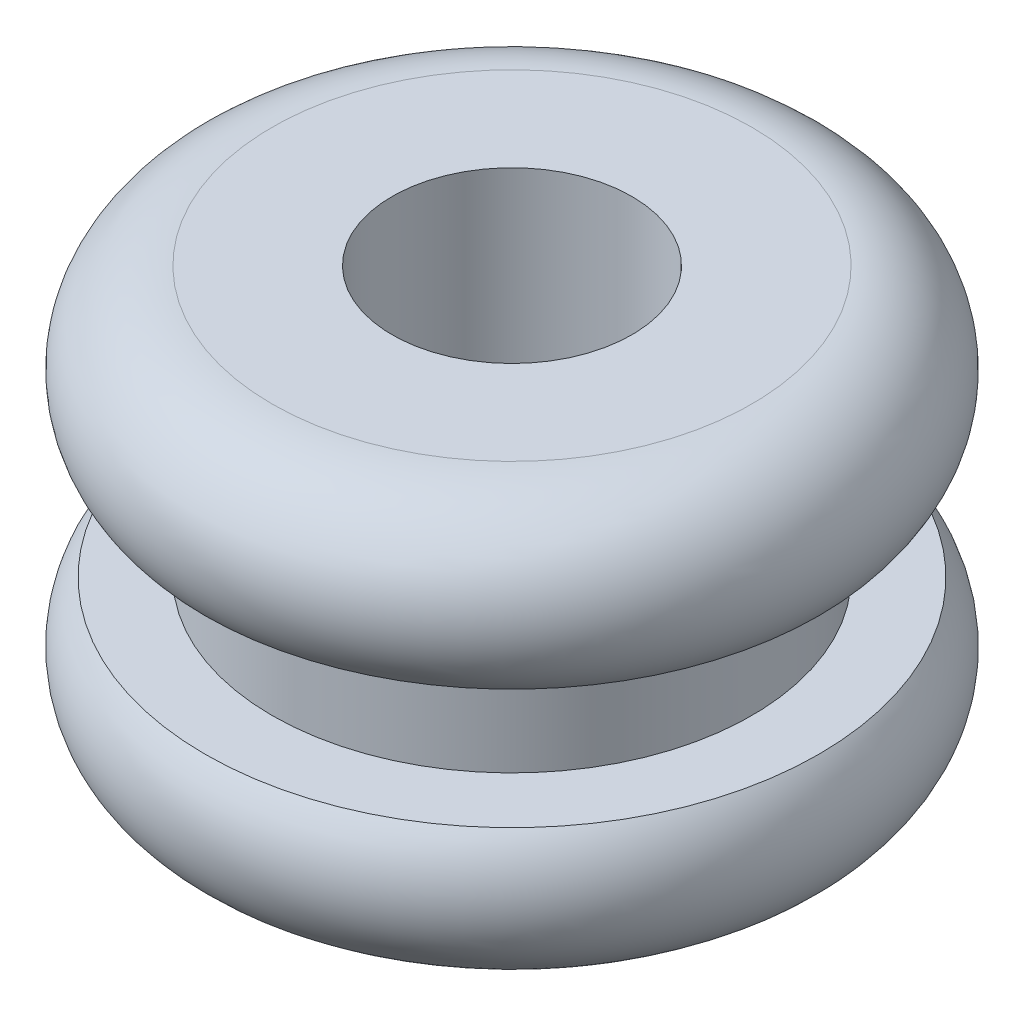
ISO-10303-21;
HEADER;
FILE_DESCRIPTION(('STEP AP214'),'2;1');
FILE_NAME('part.step','',(''),(''),'','','');
FILE_SCHEMA(('AUTOMOTIVE_DESIGN { 1 0 10303 214 1 1 1 1 }'));
ENDSEC;
DATA;
#1=APPLICATION_CONTEXT('core data for automotive mechanical design processes');
#2=APPLICATION_PROTOCOL_DEFINITION('international standard','automotive_design',2000,#1);
#3=PRODUCT_CONTEXT('',#1,'mechanical');
#4=PRODUCT('Part','Part','',(#3));
#5=PRODUCT_RELATED_PRODUCT_CATEGORY('part','',(#4));
#6=PRODUCT_DEFINITION_FORMATION('','',#4);
#7=PRODUCT_DEFINITION_CONTEXT('part definition',#1,'design');
#8=PRODUCT_DEFINITION('design','',#6,#7);
#9=PRODUCT_DEFINITION_SHAPE('','',#8);
#10=(LENGTH_UNIT() NAMED_UNIT(*) SI_UNIT(.MILLI.,.METRE.));
#11=(NAMED_UNIT(*) PLANE_ANGLE_UNIT() SI_UNIT($,.RADIAN.));
#12=(NAMED_UNIT(*) SI_UNIT($,.STERADIAN.) SOLID_ANGLE_UNIT());
#13=UNCERTAINTY_MEASURE_WITH_UNIT(LENGTH_MEASURE(1.E-05),#10,'distance_accuracy_value','');
#14=(GEOMETRIC_REPRESENTATION_CONTEXT(3) GLOBAL_UNCERTAINTY_ASSIGNED_CONTEXT((#13)) GLOBAL_UNIT_ASSIGNED_CONTEXT((#10,
#11,#12)) REPRESENTATION_CONTEXT('',''));
#15=CARTESIAN_POINT('',(0.,0.,0.));
#16=DIRECTION('',(0.,0.,1.));
#17=DIRECTION('',(1.,0.,0.));
#18=AXIS2_PLACEMENT_3D('',#15,#16,#17);
#19=CARTESIAN_POINT('',(0.,-2.778125,1.5875));
#20=DIRECTION('',(0.,1.,0.));
#21=DIRECTION('',(0.,0.,1.));
#22=AXIS2_PLACEMENT_3D('',#19,#20,#21);
#23=PLANE('',#22);
#24=CARTESIAN_POINT('',(0.,-2.778125,0.));
#25=DIRECTION('',(0.,-1.,0.));
#26=DIRECTION('',(0.,0.,-1.));
#27=AXIS2_PLACEMENT_3D('',#24,#25,#26);
#28=CIRCLE('',#27,1.5875);
#29=CARTESIAN_POINT('',(0.,-2.778125,-1.5875));
#30=VERTEX_POINT('',#29);
#31=EDGE_CURVE('E10',#30,#30,#28,.T.);
#32=ORIENTED_EDGE('',*,*,#31,.F.);
#33=EDGE_LOOP('',(#32));
#34=FACE_BOUND('',#33,.T.);
#35=CARTESIAN_POINT('',(0.,-2.778125,0.));
#36=DIRECTION('',(0.,-1.,0.));
#37=DIRECTION('',(0.,0.,-1.));
#38=AXIS2_PLACEMENT_3D('',#35,#36,#37);
#39=CIRCLE('',#38,3.175);
#40=CARTESIAN_POINT('',(0.,-2.778125,-3.175));
#41=VERTEX_POINT('',#40);
#42=EDGE_CURVE('E61',#41,#41,#39,.T.);
#43=ORIENTED_EDGE('',*,*,#42,.T.);
#44=EDGE_LOOP('',(#43));
#45=FACE_BOUND('',#44,.T.);
#46=ADVANCED_FACE('F33',(#34,#45),#23,.F.);
#47=CARTESIAN_POINT('',(0.,-2.778125,0.));
#48=DIRECTION('',(0.,-1.,0.));
#49=DIRECTION('',(0.,0.,-1.));
#50=AXIS2_PLACEMENT_3D('',#47,#48,#49);
#51=CYLINDRICAL_SURFACE('',#50,1.5875);
#52=CARTESIAN_POINT('',(0.,2.778125,0.));
#53=DIRECTION('',(0.,-1.,0.));
#54=DIRECTION('',(0.,0.,-1.));
#55=AXIS2_PLACEMENT_3D('',#52,#53,#54);
#56=CIRCLE('',#55,1.5875);
#57=CARTESIAN_POINT('',(0.,2.778125,-1.5875));
#58=VERTEX_POINT('',#57);
#59=EDGE_CURVE('E39',#58,#58,#56,.T.);
#60=ORIENTED_EDGE('',*,*,#59,.F.);
#61=EDGE_LOOP('',(#60));
#62=FACE_BOUND('',#61,.T.);
#63=ORIENTED_EDGE('',*,*,#31,.T.);
#64=EDGE_LOOP('',(#63));
#65=FACE_BOUND('',#64,.T.);
#66=ADVANCED_FACE('F98',(#62,#65),#51,.F.);
#67=CARTESIAN_POINT('',(0.,2.778125,1.5875));
#68=DIRECTION('',(0.,-1.,0.));
#69=DIRECTION('',(0.,0.,-1.));
#70=AXIS2_PLACEMENT_3D('',#67,#68,#69);
#71=PLANE('',#70);
#72=CARTESIAN_POINT('',(0.,2.778125,0.));
#73=DIRECTION('',(0.,-1.,0.));
#74=DIRECTION('',(0.,0.,-1.));
#75=AXIS2_PLACEMENT_3D('',#72,#73,#74);
#76=CIRCLE('',#75,3.175);
#77=CARTESIAN_POINT('',(0.,2.778125,-3.175));
#78=VERTEX_POINT('',#77);
#79=EDGE_CURVE('E43',#78,#78,#76,.T.);
#80=ORIENTED_EDGE('',*,*,#79,.F.);
#81=EDGE_LOOP('',(#80));
#82=FACE_BOUND('',#81,.T.);
#83=ORIENTED_EDGE('',*,*,#59,.T.);
#84=EDGE_LOOP('',(#83));
#85=FACE_BOUND('',#84,.T.);
#86=ADVANCED_FACE('F93',(#82,#85),#71,.F.);
#87=CARTESIAN_POINT('',(0.,1.5875,0.));
#88=DIRECTION('',(0.,-1.,0.));
#89=DIRECTION('',(0.,0.,-1.));
#90=AXIS2_PLACEMENT_3D('',#87,#88,#89);
#91=TOROIDAL_SURFACE('',#90,3.175,1.190625);
#92=CARTESIAN_POINT('',(0.,0.79375,0.));
#93=DIRECTION('',(0.,-1.,0.));
#94=DIRECTION('',(0.,0.,-1.));
#95=AXIS2_PLACEMENT_3D('',#92,#93,#94);
#96=CIRCLE('',#95,4.06243947857023);
#97=CARTESIAN_POINT('',(0.,0.79375,-4.06243947857023));
#98=VERTEX_POINT('',#97);
#99=EDGE_CURVE('E47',#98,#98,#96,.T.);
#100=ORIENTED_EDGE('',*,*,#99,.F.);
#101=EDGE_LOOP('',(#100));
#102=FACE_BOUND('',#101,.T.);
#103=ORIENTED_EDGE('',*,*,#79,.T.);
#104=EDGE_LOOP('',(#103));
#105=FACE_BOUND('',#104,.T.);
#106=ADVANCED_FACE('F87',(#102,#105),#91,.T.);
#107=CARTESIAN_POINT('',(0.,0.79375,3.175));
#108=DIRECTION('',(0.,1.,0.));
#109=DIRECTION('',(0.,0.,1.));
#110=AXIS2_PLACEMENT_3D('',#107,#108,#109);
#111=PLANE('',#110);
#112=CARTESIAN_POINT('',(0.,0.79375,0.));
#113=DIRECTION('',(0.,-1.,0.));
#114=DIRECTION('',(0.,0.,-1.));
#115=AXIS2_PLACEMENT_3D('',#112,#113,#114);
#116=CIRCLE('',#115,3.175);
#117=CARTESIAN_POINT('',(0.,0.79375,-3.175));
#118=VERTEX_POINT('',#117);
#119=EDGE_CURVE('E52',#118,#118,#116,.T.);
#120=ORIENTED_EDGE('',*,*,#119,.F.);
#121=EDGE_LOOP('',(#120));
#122=FACE_BOUND('',#121,.T.);
#123=ORIENTED_EDGE('',*,*,#99,.T.);
#124=EDGE_LOOP('',(#123));
#125=FACE_BOUND('',#124,.T.);
#126=ADVANCED_FACE('F81',(#122,#125),#111,.F.);
#127=CARTESIAN_POINT('',(0.,-2.778125,0.));
#128=DIRECTION('',(0.,-1.,0.));
#129=DIRECTION('',(0.,0.,-1.));
#130=AXIS2_PLACEMENT_3D('',#127,#128,#129);
#131=CYLINDRICAL_SURFACE('',#130,3.175);
#132=CARTESIAN_POINT('',(0.,-0.79375,0.));
#133=DIRECTION('',(0.,-1.,0.));
#134=DIRECTION('',(0.,0.,-1.));
#135=AXIS2_PLACEMENT_3D('',#132,#133,#134);
#136=CIRCLE('',#135,3.175);
#137=CARTESIAN_POINT('',(0.,-0.79375,-3.175));
#138=VERTEX_POINT('',#137);
#139=EDGE_CURVE('E55',#138,#138,#136,.T.);
#140=ORIENTED_EDGE('',*,*,#139,.F.);
#141=EDGE_LOOP('',(#140));
#142=FACE_BOUND('',#141,.T.);
#143=ORIENTED_EDGE('',*,*,#119,.T.);
#144=EDGE_LOOP('',(#143));
#145=FACE_BOUND('',#144,.T.);
#146=ADVANCED_FACE('F75',(#142,#145),#131,.T.);
#147=CARTESIAN_POINT('',(0.,-0.79375,3.175));
#148=DIRECTION('',(0.,-1.,0.));
#149=DIRECTION('',(0.,0.,-1.));
#150=AXIS2_PLACEMENT_3D('',#147,#148,#149);
#151=PLANE('',#150);
#152=CARTESIAN_POINT('',(0.,-0.79375,0.));
#153=DIRECTION('',(0.,-1.,0.));
#154=DIRECTION('',(0.,0.,-1.));
#155=AXIS2_PLACEMENT_3D('',#152,#153,#154);
#156=CIRCLE('',#155,4.06243947857023);
#157=CARTESIAN_POINT('',(0.,-0.79375,-4.06243947857023));
#158=VERTEX_POINT('',#157);
#159=EDGE_CURVE('E58',#158,#158,#156,.T.);
#160=ORIENTED_EDGE('',*,*,#159,.F.);
#161=EDGE_LOOP('',(#160));
#162=FACE_BOUND('',#161,.T.);
#163=ORIENTED_EDGE('',*,*,#139,.T.);
#164=EDGE_LOOP('',(#163));
#165=FACE_BOUND('',#164,.T.);
#166=ADVANCED_FACE('F69',(#162,#165),#151,.F.);
#167=CARTESIAN_POINT('',(0.,-1.5875,0.));
#168=DIRECTION('',(0.,-1.,0.));
#169=DIRECTION('',(0.,0.,-1.));
#170=AXIS2_PLACEMENT_3D('',#167,#168,#169);
#171=TOROIDAL_SURFACE('',#170,3.175,1.190625);
#172=ORIENTED_EDGE('',*,*,#42,.F.);
#173=EDGE_LOOP('',(#172));
#174=FACE_BOUND('',#173,.T.);
#175=ORIENTED_EDGE('',*,*,#159,.T.);
#176=EDGE_LOOP('',(#175));
#177=FACE_BOUND('',#176,.T.);
#178=ADVANCED_FACE('F66',(#174,#177),#171,.T.);
#179=CLOSED_SHELL('',(#46,#66,#86,#106,#126,#146,#166,#178));
#180=MANIFOLD_SOLID_BREP('B2',#179);
#181=ADVANCED_BREP_SHAPE_REPRESENTATION('',(#18,#180),#14);
#182=SHAPE_DEFINITION_REPRESENTATION(#9,#181);
ENDSEC;
END-ISO-10303-21;
